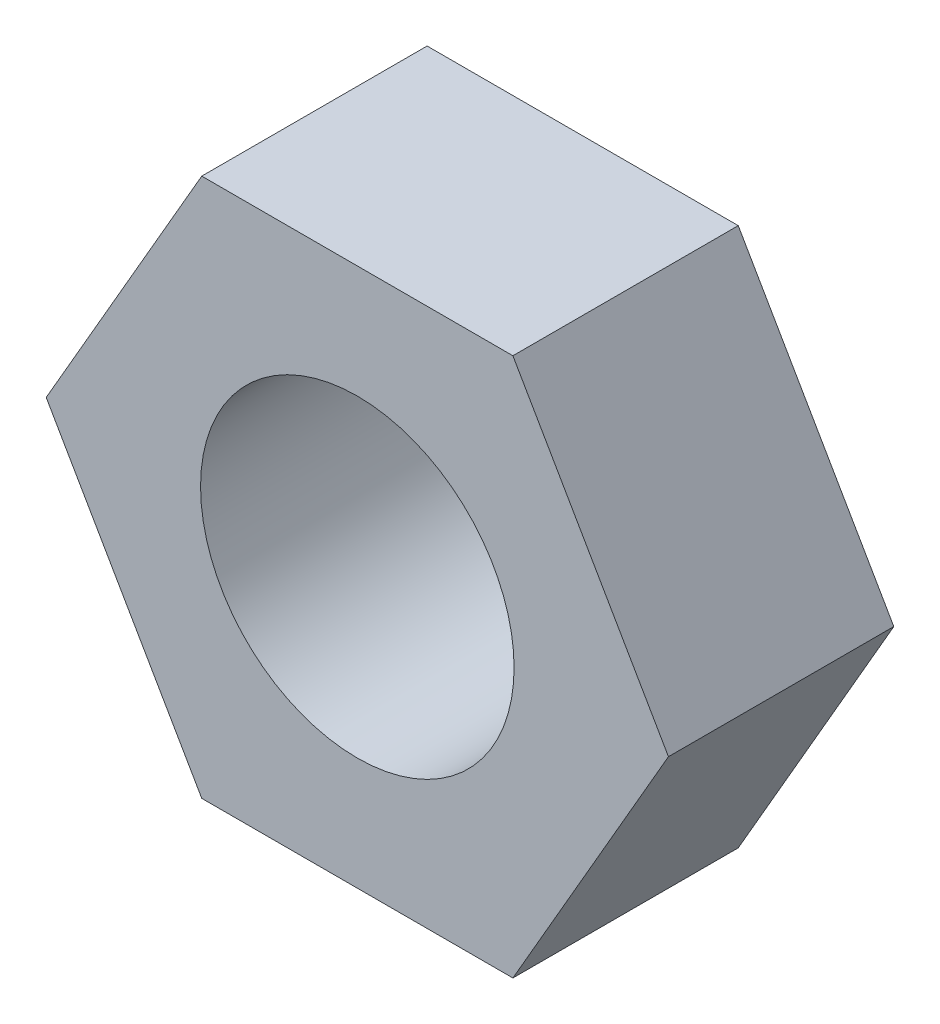
ISO-10303-21;
HEADER;
FILE_DESCRIPTION(('STEP AP214'),'2;1');
FILE_NAME('part.step','',(''),(''),'','','');
FILE_SCHEMA(('AUTOMOTIVE_DESIGN { 1 0 10303 214 1 1 1 1 }'));
ENDSEC;
DATA;
#1=APPLICATION_CONTEXT('core data for automotive mechanical design processes');
#2=APPLICATION_PROTOCOL_DEFINITION('international standard','automotive_design',2000,#1);
#3=PRODUCT_CONTEXT('',#1,'mechanical');
#4=PRODUCT('Part','Part','',(#3));
#5=PRODUCT_RELATED_PRODUCT_CATEGORY('part','',(#4));
#6=PRODUCT_DEFINITION_FORMATION('','',#4);
#7=PRODUCT_DEFINITION_CONTEXT('part definition',#1,'design');
#8=PRODUCT_DEFINITION('design','',#6,#7);
#9=PRODUCT_DEFINITION_SHAPE('','',#8);
#10=(LENGTH_UNIT() NAMED_UNIT(*) SI_UNIT(.MILLI.,.METRE.));
#11=(NAMED_UNIT(*) PLANE_ANGLE_UNIT() SI_UNIT($,.RADIAN.));
#12=(NAMED_UNIT(*) SI_UNIT($,.STERADIAN.) SOLID_ANGLE_UNIT());
#13=UNCERTAINTY_MEASURE_WITH_UNIT(LENGTH_MEASURE(1.E-05),#10,'distance_accuracy_value','');
#14=(GEOMETRIC_REPRESENTATION_CONTEXT(3) GLOBAL_UNCERTAINTY_ASSIGNED_CONTEXT((#13)) GLOBAL_UNIT_ASSIGNED_CONTEXT((#10,
#11,#12)) REPRESENTATION_CONTEXT('',''));
#15=CARTESIAN_POINT('',(0.,0.,0.));
#16=DIRECTION('',(0.,0.,1.));
#17=DIRECTION('',(1.,0.,0.));
#18=AXIS2_PLACEMENT_3D('',#15,#16,#17);
#19=CARTESIAN_POINT('',(3.15060041896779,-5.45699999999999,4.564));
#20=DIRECTION('',(-0.866025403784439,0.5,0.));
#21=DIRECTION('',(-0.5,-0.866025403784439,0.));
#22=AXIS2_PLACEMENT_3D('',#19,#20,#21);
#23=PLANE('',#22);
#24=DIRECTION('',(0.5,0.866025403784439,0.));
#25=VECTOR('',#24,1.);
#26=CARTESIAN_POINT('',(3.15060041896779,-5.45699999999999,0.));
#27=LINE('',#26,#25);
#28=CARTESIAN_POINT('',(3.15060041896779,-5.45699999999999,0.));
#29=VERTEX_POINT('',#28);
#30=CARTESIAN_POINT('',(6.30120083793558,0.,0.));
#31=VERTEX_POINT('',#30);
#32=EDGE_CURVE('E121',#29,#31,#27,.T.);
#33=ORIENTED_EDGE('',*,*,#32,.T.);
#34=DIRECTION('',(0.,0.,-1.));
#35=VECTOR('',#34,1.);
#36=CARTESIAN_POINT('',(6.30120083793558,0.,4.564));
#37=LINE('',#36,#35);
#38=CARTESIAN_POINT('',(6.30120083793558,0.,4.564));
#39=VERTEX_POINT('',#38);
#40=EDGE_CURVE('E11',#39,#31,#37,.T.);
#41=ORIENTED_EDGE('',*,*,#40,.F.);
#42=DIRECTION('',(0.5,0.866025403784439,0.));
#43=VECTOR('',#42,1.);
#44=CARTESIAN_POINT('',(3.15060041896779,-5.45699999999999,4.564));
#45=LINE('',#44,#43);
#46=CARTESIAN_POINT('',(3.15060041896779,-5.45699999999999,4.564));
#47=VERTEX_POINT('',#46);
#48=EDGE_CURVE('E132',#47,#39,#45,.T.);
#49=ORIENTED_EDGE('',*,*,#48,.F.);
#50=DIRECTION('',(0.,0.,-1.));
#51=VECTOR('',#50,1.);
#52=CARTESIAN_POINT('',(3.15060041896779,-5.45699999999999,4.564));
#53=LINE('',#52,#51);
#54=EDGE_CURVE('E117',#47,#29,#53,.T.);
#55=ORIENTED_EDGE('',*,*,#54,.T.);
#56=EDGE_LOOP('',(#33,#41,#49,#55));
#57=FACE_BOUND('',#56,.T.);
#58=ADVANCED_FACE('F37',(#57),#23,.F.);
#59=CARTESIAN_POINT('',(6.30120083793558,0.,4.564));
#60=DIRECTION('',(-0.866025403784439,-0.5,0.));
#61=DIRECTION('',(0.5,-0.866025403784439,0.));
#62=AXIS2_PLACEMENT_3D('',#59,#60,#61);
#63=PLANE('',#62);
#64=DIRECTION('',(-0.5,0.866025403784439,0.));
#65=VECTOR('',#64,1.);
#66=CARTESIAN_POINT('',(6.30120083793558,0.,0.));
#67=LINE('',#66,#65);
#68=CARTESIAN_POINT('',(3.15060041896779,5.457,0.));
#69=VERTEX_POINT('',#68);
#70=EDGE_CURVE('E124',#31,#69,#67,.T.);
#71=ORIENTED_EDGE('',*,*,#70,.T.);
#72=DIRECTION('',(0.,0.,-1.));
#73=VECTOR('',#72,1.);
#74=CARTESIAN_POINT('',(3.15060041896779,5.457,4.564));
#75=LINE('',#74,#73);
#76=CARTESIAN_POINT('',(3.15060041896779,5.457,4.564));
#77=VERTEX_POINT('',#76);
#78=EDGE_CURVE('E45',#77,#69,#75,.T.);
#79=ORIENTED_EDGE('',*,*,#78,.F.);
#80=DIRECTION('',(-0.5,0.866025403784439,0.));
#81=VECTOR('',#80,1.);
#82=CARTESIAN_POINT('',(6.30120083793558,0.,4.564));
#83=LINE('',#82,#81);
#84=EDGE_CURVE('E90',#39,#77,#83,.T.);
#85=ORIENTED_EDGE('',*,*,#84,.F.);
#86=ORIENTED_EDGE('',*,*,#40,.T.);
#87=EDGE_LOOP('',(#71,#79,#85,#86));
#88=FACE_BOUND('',#87,.T.);
#89=ADVANCED_FACE('F157',(#88),#63,.F.);
#90=CARTESIAN_POINT('',(3.15060041896779,5.457,4.564));
#91=DIRECTION('',(0.,-1.,0.));
#92=DIRECTION('',(1.,0.,0.));
#93=AXIS2_PLACEMENT_3D('',#90,#91,#92);
#94=PLANE('',#93);
#95=DIRECTION('',(-1.,0.,0.));
#96=VECTOR('',#95,1.);
#97=CARTESIAN_POINT('',(3.15060041896779,5.457,0.));
#98=LINE('',#97,#96);
#99=CARTESIAN_POINT('',(-3.15060041896779,5.45700000000001,0.));
#100=VERTEX_POINT('',#99);
#101=EDGE_CURVE('E127',#69,#100,#98,.T.);
#102=ORIENTED_EDGE('',*,*,#101,.T.);
#103=DIRECTION('',(0.,0.,-1.));
#104=VECTOR('',#103,1.);
#105=CARTESIAN_POINT('',(-3.15060041896779,5.45700000000001,4.564));
#106=LINE('',#105,#104);
#107=CARTESIAN_POINT('',(-3.15060041896779,5.45700000000001,4.564));
#108=VERTEX_POINT('',#107);
#109=EDGE_CURVE('E112',#108,#100,#106,.T.);
#110=ORIENTED_EDGE('',*,*,#109,.F.);
#111=DIRECTION('',(-1.,0.,0.));
#112=VECTOR('',#111,1.);
#113=CARTESIAN_POINT('',(3.15060041896779,5.457,4.564));
#114=LINE('',#113,#112);
#115=EDGE_CURVE('E103',#77,#108,#114,.T.);
#116=ORIENTED_EDGE('',*,*,#115,.F.);
#117=ORIENTED_EDGE('',*,*,#78,.T.);
#118=EDGE_LOOP('',(#102,#110,#116,#117));
#119=FACE_BOUND('',#118,.T.);
#120=ADVANCED_FACE('F138',(#119),#94,.F.);
#121=CARTESIAN_POINT('',(-3.15060041896779,5.45700000000001,4.564));
#122=DIRECTION('',(0.866025403784439,-0.5,0.));
#123=DIRECTION('',(0.5,0.866025403784439,0.));
#124=AXIS2_PLACEMENT_3D('',#121,#122,#123);
#125=PLANE('',#124);
#126=DIRECTION('',(-0.5,-0.866025403784439,0.));
#127=VECTOR('',#126,1.);
#128=CARTESIAN_POINT('',(-3.15060041896779,5.45700000000001,0.));
#129=LINE('',#128,#127);
#130=CARTESIAN_POINT('',(-6.30120083793557,0.,0.));
#131=VERTEX_POINT('',#130);
#132=EDGE_CURVE('E111',#100,#131,#129,.T.);
#133=ORIENTED_EDGE('',*,*,#132,.T.);
#134=DIRECTION('',(0.,0.,-1.));
#135=VECTOR('',#134,1.);
#136=CARTESIAN_POINT('',(-6.30120083793557,0.,4.564));
#137=LINE('',#136,#135);
#138=CARTESIAN_POINT('',(-6.30120083793557,0.,4.564));
#139=VERTEX_POINT('',#138);
#140=EDGE_CURVE('E108',#139,#131,#137,.T.);
#141=ORIENTED_EDGE('',*,*,#140,.F.);
#142=DIRECTION('',(-0.5,-0.866025403784439,0.));
#143=VECTOR('',#142,1.);
#144=CARTESIAN_POINT('',(-3.15060041896779,5.45700000000001,4.564));
#145=LINE('',#144,#143);
#146=EDGE_CURVE('E97',#108,#139,#145,.T.);
#147=ORIENTED_EDGE('',*,*,#146,.F.);
#148=ORIENTED_EDGE('',*,*,#109,.T.);
#149=EDGE_LOOP('',(#133,#141,#147,#148));
#150=FACE_BOUND('',#149,.T.);
#151=ADVANCED_FACE('F109',(#150),#125,.F.);
#152=CARTESIAN_POINT('',(-6.30120083793557,0.,4.564));
#153=DIRECTION('',(0.866025403784439,0.5,0.));
#154=DIRECTION('',(-0.5,0.866025403784439,0.));
#155=AXIS2_PLACEMENT_3D('',#152,#153,#154);
#156=PLANE('',#155);
#157=DIRECTION('',(0.5,-0.866025403784439,0.));
#158=VECTOR('',#157,1.);
#159=CARTESIAN_POINT('',(-6.30120083793557,0.,0.));
#160=LINE('',#159,#158);
#161=CARTESIAN_POINT('',(-3.15060041896779,-5.45699999999999,0.));
#162=VERTEX_POINT('',#161);
#163=EDGE_CURVE('E76',#131,#162,#160,.T.);
#164=ORIENTED_EDGE('',*,*,#163,.T.);
#165=DIRECTION('',(0.,0.,-1.));
#166=VECTOR('',#165,1.);
#167=CARTESIAN_POINT('',(-3.15060041896779,-5.45699999999999,4.564));
#168=LINE('',#167,#166);
#169=CARTESIAN_POINT('',(-3.15060041896779,-5.45699999999999,4.564));
#170=VERTEX_POINT('',#169);
#171=EDGE_CURVE('E113',#170,#162,#168,.T.);
#172=ORIENTED_EDGE('',*,*,#171,.F.);
#173=DIRECTION('',(0.5,-0.866025403784439,0.));
#174=VECTOR('',#173,1.);
#175=CARTESIAN_POINT('',(-6.30120083793557,0.,4.564));
#176=LINE('',#175,#174);
#177=EDGE_CURVE('E101',#139,#170,#176,.T.);
#178=ORIENTED_EDGE('',*,*,#177,.F.);
#179=ORIENTED_EDGE('',*,*,#140,.T.);
#180=EDGE_LOOP('',(#164,#172,#178,#179));
#181=FACE_BOUND('',#180,.T.);
#182=ADVANCED_FACE('F115',(#181),#156,.F.);
#183=CARTESIAN_POINT('',(-3.15060041896779,-5.45699999999999,4.564));
#184=DIRECTION('',(0.,1.,0.));
#185=DIRECTION('',(0.,0.,1.));
#186=AXIS2_PLACEMENT_3D('',#183,#184,#185);
#187=PLANE('',#186);
#188=DIRECTION('',(1.,0.,0.));
#189=VECTOR('',#188,1.);
#190=CARTESIAN_POINT('',(-3.15060041896779,-5.45699999999999,0.));
#191=LINE('',#190,#189);
#192=EDGE_CURVE('E82',#162,#29,#191,.T.);
#193=ORIENTED_EDGE('',*,*,#192,.T.);
#194=ORIENTED_EDGE('',*,*,#54,.F.);
#195=DIRECTION('',(1.,0.,0.));
#196=VECTOR('',#195,1.);
#197=CARTESIAN_POINT('',(-3.15060041896779,-5.45699999999999,4.564));
#198=LINE('',#197,#196);
#199=EDGE_CURVE('E53',#170,#47,#198,.T.);
#200=ORIENTED_EDGE('',*,*,#199,.F.);
#201=ORIENTED_EDGE('',*,*,#171,.T.);
#202=EDGE_LOOP('',(#193,#194,#200,#201));
#203=FACE_BOUND('',#202,.T.);
#204=ADVANCED_FACE('F145',(#203),#187,.F.);
#205=CARTESIAN_POINT('',(0.,0.,4.564));
#206=DIRECTION('',(0.,0.,1.));
#207=DIRECTION('',(1.,0.,0.));
#208=AXIS2_PLACEMENT_3D('',#205,#206,#207);
#209=PLANE('',#208);
#210=CARTESIAN_POINT('',(0.,0.,4.564));
#211=DIRECTION('',(0.,0.,1.));
#212=DIRECTION('',(1.,0.,0.));
#213=AXIS2_PLACEMENT_3D('',#210,#211,#212);
#214=CIRCLE('',#213,3.175);
#215=CARTESIAN_POINT('',(3.175,0.,4.564));
#216=VERTEX_POINT('',#215);
#217=EDGE_CURVE('E244',#216,#216,#214,.T.);
#218=ORIENTED_EDGE('',*,*,#217,.F.);
#219=EDGE_LOOP('',(#218));
#220=FACE_BOUND('',#219,.T.);
#221=ORIENTED_EDGE('',*,*,#48,.T.);
#222=ORIENTED_EDGE('',*,*,#84,.T.);
#223=ORIENTED_EDGE('',*,*,#115,.T.);
#224=ORIENTED_EDGE('',*,*,#146,.T.);
#225=ORIENTED_EDGE('',*,*,#177,.T.);
#226=ORIENTED_EDGE('',*,*,#199,.T.);
#227=EDGE_LOOP('',(#221,#222,#223,#224,#225,#226));
#228=FACE_BOUND('',#227,.T.);
#229=ADVANCED_FACE('F99',(#220,#228),#209,.T.);
#230=CARTESIAN_POINT('',(0.,0.,0.));
#231=DIRECTION('',(0.,0.,1.));
#232=DIRECTION('',(1.,0.,0.));
#233=AXIS2_PLACEMENT_3D('',#230,#231,#232);
#234=PLANE('',#233);
#235=CARTESIAN_POINT('',(0.,0.,0.));
#236=DIRECTION('',(0.,0.,1.));
#237=DIRECTION('',(1.,0.,0.));
#238=AXIS2_PLACEMENT_3D('',#235,#236,#237);
#239=CIRCLE('',#238,3.175);
#240=CARTESIAN_POINT('',(3.175,0.,0.));
#241=VERTEX_POINT('',#240);
#242=EDGE_CURVE('E125',#241,#241,#239,.T.);
#243=ORIENTED_EDGE('',*,*,#242,.T.);
#244=EDGE_LOOP('',(#243));
#245=FACE_BOUND('',#244,.T.);
#246=ORIENTED_EDGE('',*,*,#32,.F.);
#247=ORIENTED_EDGE('',*,*,#192,.F.);
#248=ORIENTED_EDGE('',*,*,#163,.F.);
#249=ORIENTED_EDGE('',*,*,#132,.F.);
#250=ORIENTED_EDGE('',*,*,#101,.F.);
#251=ORIENTED_EDGE('',*,*,#70,.F.);
#252=EDGE_LOOP('',(#246,#247,#248,#249,#250,#251));
#253=FACE_BOUND('',#252,.T.);
#254=ADVANCED_FACE('F141',(#245,#253),#234,.F.);
#255=CARTESIAN_POINT('',(0.,0.,0.));
#256=DIRECTION('',(0.,0.,1.));
#257=DIRECTION('',(1.,0.,0.));
#258=AXIS2_PLACEMENT_3D('',#255,#256,#257);
#259=CYLINDRICAL_SURFACE('',#258,3.175);
#260=ORIENTED_EDGE('',*,*,#242,.F.);
#261=EDGE_LOOP('',(#260));
#262=FACE_BOUND('',#261,.T.);
#263=ORIENTED_EDGE('',*,*,#217,.T.);
#264=EDGE_LOOP('',(#263));
#265=FACE_BOUND('',#264,.T.);
#266=ADVANCED_FACE('F197',(#262,#265),#259,.F.);
#267=CLOSED_SHELL('',(#58,#89,#120,#151,#182,#204,#229,#254,#266));
#268=MANIFOLD_SOLID_BREP('B2',#267);
#269=ADVANCED_BREP_SHAPE_REPRESENTATION('',(#18,#268),#14);
#270=SHAPE_DEFINITION_REPRESENTATION(#9,#269);
ENDSEC;
END-ISO-10303-21;
